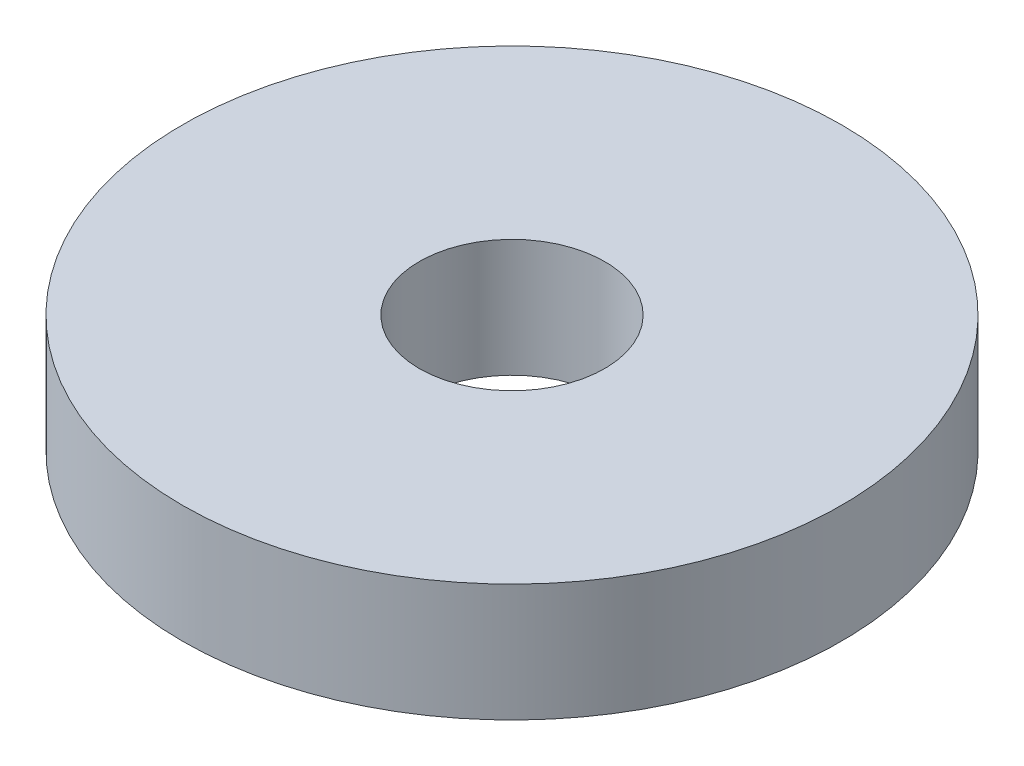
ISO-10303-21;
HEADER;
FILE_DESCRIPTION(('STEP AP214'),'2;1');
FILE_NAME('part.step','',(''),(''),'','','');
FILE_SCHEMA(('AUTOMOTIVE_DESIGN { 1 0 10303 214 1 1 1 1 }'));
ENDSEC;
DATA;
#1=APPLICATION_CONTEXT('core data for automotive mechanical design processes');
#2=APPLICATION_PROTOCOL_DEFINITION('international standard','automotive_design',2000,#1);
#3=PRODUCT_CONTEXT('',#1,'mechanical');
#4=PRODUCT('Part','Part','',(#3));
#5=PRODUCT_RELATED_PRODUCT_CATEGORY('part','',(#4));
#6=PRODUCT_DEFINITION_FORMATION('','',#4);
#7=PRODUCT_DEFINITION_CONTEXT('part definition',#1,'design');
#8=PRODUCT_DEFINITION('design','',#6,#7);
#9=PRODUCT_DEFINITION_SHAPE('','',#8);
#10=(LENGTH_UNIT() NAMED_UNIT(*) SI_UNIT(.MILLI.,.METRE.));
#11=(NAMED_UNIT(*) PLANE_ANGLE_UNIT() SI_UNIT($,.RADIAN.));
#12=(NAMED_UNIT(*) SI_UNIT($,.STERADIAN.) SOLID_ANGLE_UNIT());
#13=UNCERTAINTY_MEASURE_WITH_UNIT(LENGTH_MEASURE(1.E-05),#10,'distance_accuracy_value','');
#14=(GEOMETRIC_REPRESENTATION_CONTEXT(3) GLOBAL_UNCERTAINTY_ASSIGNED_CONTEXT((#13)) GLOBAL_UNIT_ASSIGNED_CONTEXT((#10,
#11,#12)) REPRESENTATION_CONTEXT('',''));
#15=CARTESIAN_POINT('',(0.,0.,0.));
#16=DIRECTION('',(0.,0.,1.));
#17=DIRECTION('',(1.,0.,0.));
#18=AXIS2_PLACEMENT_3D('',#15,#16,#17);
#19=CARTESIAN_POINT('',(0.,3.175,0.));
#20=DIRECTION('',(0.,1.,0.));
#21=DIRECTION('',(0.,0.,1.));
#22=AXIS2_PLACEMENT_3D('',#19,#20,#21);
#23=PLANE('',#22);
#24=CARTESIAN_POINT('',(0.,3.175,0.));
#25=DIRECTION('',(0.,1.,0.));
#26=DIRECTION('',(0.,0.,1.));
#27=AXIS2_PLACEMENT_3D('',#24,#25,#26);
#28=CIRCLE('',#27,8.89);
#29=CARTESIAN_POINT('',(0.,3.175,8.89));
#30=VERTEX_POINT('',#29);
#31=EDGE_CURVE('E10',#30,#30,#28,.T.);
#32=ORIENTED_EDGE('',*,*,#31,.T.);
#33=EDGE_LOOP('',(#32));
#34=FACE_BOUND('',#33,.T.);
#35=CARTESIAN_POINT('',(0.,3.175,0.));
#36=DIRECTION('',(0.,1.,0.));
#37=DIRECTION('',(0.,0.,1.));
#38=AXIS2_PLACEMENT_3D('',#35,#36,#37);
#39=CIRCLE('',#38,2.5019);
#40=CARTESIAN_POINT('',(0.,3.175,2.5019));
#41=VERTEX_POINT('',#40);
#42=EDGE_CURVE('E42',#41,#41,#39,.T.);
#43=ORIENTED_EDGE('',*,*,#42,.F.);
#44=EDGE_LOOP('',(#43));
#45=FACE_BOUND('',#44,.T.);
#46=ADVANCED_FACE('F31',(#34,#45),#23,.T.);
#47=CARTESIAN_POINT('',(0.,0.,0.));
#48=DIRECTION('',(0.,1.,0.));
#49=DIRECTION('',(0.,0.,1.));
#50=AXIS2_PLACEMENT_3D('',#47,#48,#49);
#51=PLANE('',#50);
#52=CARTESIAN_POINT('',(0.,0.,0.));
#53=DIRECTION('',(0.,1.,0.));
#54=DIRECTION('',(0.,0.,1.));
#55=AXIS2_PLACEMENT_3D('',#52,#53,#54);
#56=CIRCLE('',#55,8.89);
#57=CARTESIAN_POINT('',(0.,0.,8.89));
#58=VERTEX_POINT('',#57);
#59=EDGE_CURVE('E35',#58,#58,#56,.T.);
#60=ORIENTED_EDGE('',*,*,#59,.F.);
#61=EDGE_LOOP('',(#60));
#62=FACE_BOUND('',#61,.T.);
#63=CARTESIAN_POINT('',(0.,0.,0.));
#64=DIRECTION('',(0.,1.,0.));
#65=DIRECTION('',(0.,0.,1.));
#66=AXIS2_PLACEMENT_3D('',#63,#64,#65);
#67=CIRCLE('',#66,2.5019);
#68=CARTESIAN_POINT('',(0.,0.,2.5019));
#69=VERTEX_POINT('',#68);
#70=EDGE_CURVE('E44',#69,#69,#67,.T.);
#71=ORIENTED_EDGE('',*,*,#70,.T.);
#72=EDGE_LOOP('',(#71));
#73=FACE_BOUND('',#72,.T.);
#74=ADVANCED_FACE('F54',(#62,#73),#51,.F.);
#75=CARTESIAN_POINT('',(0.,3.175,0.));
#76=DIRECTION('',(0.,-1.,0.));
#77=DIRECTION('',(0.,0.,-1.));
#78=AXIS2_PLACEMENT_3D('',#75,#76,#77);
#79=CYLINDRICAL_SURFACE('',#78,8.89);
#80=ORIENTED_EDGE('',*,*,#31,.F.);
#81=EDGE_LOOP('',(#80));
#82=FACE_BOUND('',#81,.T.);
#83=ORIENTED_EDGE('',*,*,#59,.T.);
#84=EDGE_LOOP('',(#83));
#85=FACE_BOUND('',#84,.T.);
#86=ADVANCED_FACE('F33',(#82,#85),#79,.T.);
#87=CARTESIAN_POINT('',(0.,3.175,0.));
#88=DIRECTION('',(0.,-1.,0.));
#89=DIRECTION('',(0.,0.,-1.));
#90=AXIS2_PLACEMENT_3D('',#87,#88,#89);
#91=CYLINDRICAL_SURFACE('',#90,2.5019);
#92=ORIENTED_EDGE('',*,*,#42,.T.);
#93=EDGE_LOOP('',(#92));
#94=FACE_BOUND('',#93,.T.);
#95=ORIENTED_EDGE('',*,*,#70,.F.);
#96=EDGE_LOOP('',(#95));
#97=FACE_BOUND('',#96,.T.);
#98=ADVANCED_FACE('F50',(#94,#97),#91,.F.);
#99=CLOSED_SHELL('',(#46,#74,#86,#98));
#100=MANIFOLD_SOLID_BREP('B2',#99);
#101=ADVANCED_BREP_SHAPE_REPRESENTATION('',(#18,#100),#14);
#102=SHAPE_DEFINITION_REPRESENTATION(#9,#101);
ENDSEC;
END-ISO-10303-21;
